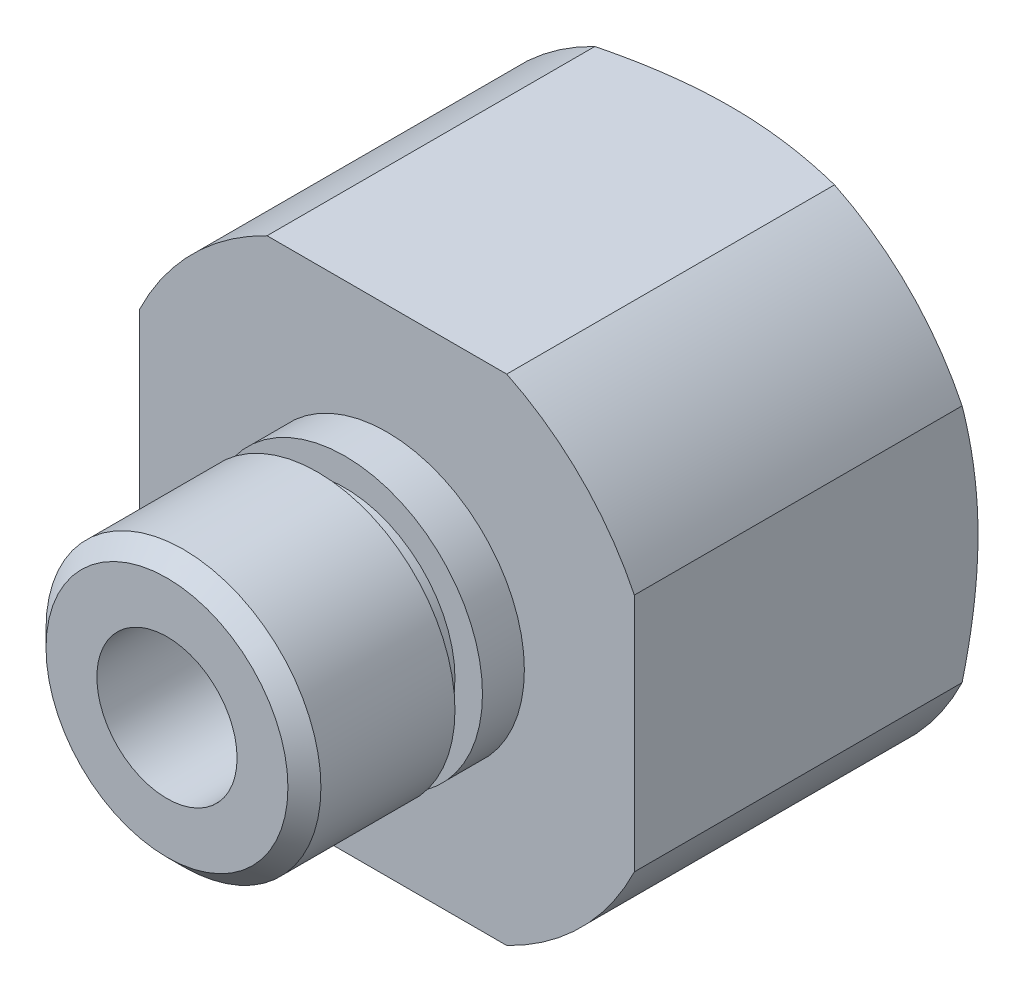
ISO-10303-21;
HEADER;
FILE_DESCRIPTION(('STEP AP214'),'2;1');
FILE_NAME('part.step','',(''),(''),'','','');
FILE_SCHEMA(('AUTOMOTIVE_DESIGN { 1 0 10303 214 1 1 1 1 }'));
ENDSEC;
DATA;
#1=APPLICATION_CONTEXT('core data for automotive mechanical design processes');
#2=APPLICATION_PROTOCOL_DEFINITION('international standard','automotive_design',2000,#1);
#3=PRODUCT_CONTEXT('',#1,'mechanical');
#4=PRODUCT('Part','Part','',(#3));
#5=PRODUCT_RELATED_PRODUCT_CATEGORY('part','',(#4));
#6=PRODUCT_DEFINITION_FORMATION('','',#4);
#7=PRODUCT_DEFINITION_CONTEXT('part definition',#1,'design');
#8=PRODUCT_DEFINITION('design','',#6,#7);
#9=PRODUCT_DEFINITION_SHAPE('','',#8);
#10=(LENGTH_UNIT() NAMED_UNIT(*) SI_UNIT(.MILLI.,.METRE.));
#11=(NAMED_UNIT(*) PLANE_ANGLE_UNIT() SI_UNIT($,.RADIAN.));
#12=(NAMED_UNIT(*) SI_UNIT($,.STERADIAN.) SOLID_ANGLE_UNIT());
#13=UNCERTAINTY_MEASURE_WITH_UNIT(LENGTH_MEASURE(1.E-05),#10,'distance_accuracy_value','');
#14=(GEOMETRIC_REPRESENTATION_CONTEXT(3) GLOBAL_UNCERTAINTY_ASSIGNED_CONTEXT((#13)) GLOBAL_UNIT_ASSIGNED_CONTEXT((#10,
#11,#12)) REPRESENTATION_CONTEXT('',''));
#15=CARTESIAN_POINT('',(0.,0.,0.));
#16=DIRECTION('',(0.,0.,1.));
#17=DIRECTION('',(1.,0.,0.));
#18=AXIS2_PLACEMENT_3D('',#15,#16,#17);
#19=CARTESIAN_POINT('',(0.,0.,20.5));
#20=DIRECTION('',(0.,0.,-1.));
#21=DIRECTION('',(-1.,0.,0.));
#22=AXIS2_PLACEMENT_3D('',#19,#20,#21);
#23=CYLINDRICAL_SURFACE('',#22,5.);
#24=CARTESIAN_POINT('',(0.,0.,12.5));
#25=DIRECTION('',(0.,0.,1.));
#26=DIRECTION('',(1.,0.,0.));
#27=AXIS2_PLACEMENT_3D('',#24,#25,#26);
#28=CIRCLE('',#27,5.);
#29=CARTESIAN_POINT('',(5.,0.,12.5));
#30=VERTEX_POINT('',#29);
#31=EDGE_CURVE('E133',#30,#30,#28,.T.);
#32=ORIENTED_EDGE('',*,*,#31,.T.);
#33=EDGE_LOOP('',(#32));
#34=FACE_BOUND('',#33,.T.);
#35=CARTESIAN_POINT('',(0.,0.,14.0240000000003));
#36=DIRECTION('',(0.,0.,1.));
#37=DIRECTION('',(1.,0.,0.));
#38=AXIS2_PLACEMENT_3D('',#35,#36,#37);
#39=CIRCLE('',#38,5.);
#40=CARTESIAN_POINT('',(5.,0.,14.0240000000003));
#41=VERTEX_POINT('',#40);
#42=EDGE_CURVE('E331',#41,#41,#39,.T.);
#43=ORIENTED_EDGE('',*,*,#42,.F.);
#44=EDGE_LOOP('',(#43));
#45=FACE_BOUND('',#44,.T.);
#46=ADVANCED_FACE('F36',(#34,#45),#23,.T.);
#47=CARTESIAN_POINT('',(0.,0.,0.));
#48=DIRECTION('',(0.,0.,1.));
#49=DIRECTION('',(1.,0.,0.));
#50=AXIS2_PLACEMENT_3D('',#47,#48,#49);
#51=PLANE('',#50);
#52=CARTESIAN_POINT('',(0.,0.,0.));
#53=DIRECTION('',(0.,0.,1.));
#54=DIRECTION('',(1.,0.,0.));
#55=AXIS2_PLACEMENT_3D('',#52,#53,#54);
#56=CIRCLE('',#55,9.);
#57=CARTESIAN_POINT('',(8.99999999999999,0.,0.));
#58=VERTEX_POINT('',#57);
#59=CARTESIAN_POINT('',(0.,-9.,0.));
#60=VERTEX_POINT('',#59);
#61=EDGE_CURVE('E319',#58,#60,#56,.F.);
#62=ORIENTED_EDGE('',*,*,#61,.T.);
#63=CARTESIAN_POINT('',(0.,0.,0.));
#64=DIRECTION('',(0.,0.,1.));
#65=DIRECTION('',(1.,0.,0.));
#66=AXIS2_PLACEMENT_3D('',#63,#64,#65);
#67=CIRCLE('',#66,9.);
#68=CARTESIAN_POINT('',(-8.99999999999999,0.,0.));
#69=VERTEX_POINT('',#68);
#70=EDGE_CURVE('E313',#60,#69,#67,.F.);
#71=ORIENTED_EDGE('',*,*,#70,.T.);
#72=CARTESIAN_POINT('',(0.,0.,0.));
#73=DIRECTION('',(0.,0.,1.));
#74=DIRECTION('',(1.,0.,0.));
#75=AXIS2_PLACEMENT_3D('',#72,#73,#74);
#76=CIRCLE('',#75,9.);
#77=CARTESIAN_POINT('',(0.,9.,0.));
#78=VERTEX_POINT('',#77);
#79=EDGE_CURVE('E317',#69,#78,#76,.F.);
#80=ORIENTED_EDGE('',*,*,#79,.T.);
#81=CARTESIAN_POINT('',(0.,0.,0.));
#82=DIRECTION('',(0.,0.,1.));
#83=DIRECTION('',(1.,0.,0.));
#84=AXIS2_PLACEMENT_3D('',#81,#82,#83);
#85=CIRCLE('',#84,9.);
#86=EDGE_CURVE('E315',#78,#58,#85,.F.);
#87=ORIENTED_EDGE('',*,*,#86,.T.);
#88=EDGE_LOOP('',(#62,#71,#80,#87));
#89=FACE_BOUND('',#88,.T.);
#90=CARTESIAN_POINT('',(0.,0.,0.));
#91=DIRECTION('',(0.,0.,1.));
#92=DIRECTION('',(1.,0.,0.));
#93=AXIS2_PLACEMENT_3D('',#90,#91,#92);
#94=CIRCLE('',#93,2.55);
#95=CARTESIAN_POINT('',(2.55,0.,0.));
#96=VERTEX_POINT('',#95);
#97=EDGE_CURVE('E325',#96,#96,#94,.T.);
#98=ORIENTED_EDGE('',*,*,#97,.T.);
#99=EDGE_LOOP('',(#98));
#100=FACE_BOUND('',#99,.T.);
#101=ADVANCED_FACE('F197',(#89,#100),#51,.F.);
#102=CARTESIAN_POINT('',(0.,0.,20.5));
#103=DIRECTION('',(0.,0.,1.));
#104=DIRECTION('',(1.,0.,0.));
#105=AXIS2_PLACEMENT_3D('',#102,#103,#104);
#106=PLANE('',#105);
#107=CARTESIAN_POINT('',(0.,0.,20.5));
#108=DIRECTION('',(0.,0.,1.));
#109=DIRECTION('',(1.,0.,0.));
#110=AXIS2_PLACEMENT_3D('',#107,#108,#109);
#111=CIRCLE('',#110,4.4);
#112=CARTESIAN_POINT('',(4.4,0.,20.5));
#113=VERTEX_POINT('',#112);
#114=EDGE_CURVE('E44',#113,#113,#111,.T.);
#115=ORIENTED_EDGE('',*,*,#114,.T.);
#116=EDGE_LOOP('',(#115));
#117=FACE_BOUND('',#116,.T.);
#118=CARTESIAN_POINT('',(0.,0.,20.5));
#119=DIRECTION('',(0.,0.,1.));
#120=DIRECTION('',(1.,0.,0.));
#121=AXIS2_PLACEMENT_3D('',#118,#119,#120);
#122=CIRCLE('',#121,2.55);
#123=CARTESIAN_POINT('',(2.55,0.,20.5));
#124=VERTEX_POINT('',#123);
#125=EDGE_CURVE('E327',#124,#124,#122,.T.);
#126=ORIENTED_EDGE('',*,*,#125,.F.);
#127=EDGE_LOOP('',(#126));
#128=FACE_BOUND('',#127,.T.);
#129=ADVANCED_FACE('F201',(#117,#128),#106,.T.);
#130=CARTESIAN_POINT('',(0.,0.,12.5));
#131=DIRECTION('',(0.,0.,1.));
#132=DIRECTION('',(1.,0.,0.));
#133=AXIS2_PLACEMENT_3D('',#130,#131,#132);
#134=PLANE('',#133);
#135=CARTESIAN_POINT('',(0.,0.,12.5));
#136=DIRECTION('',(0.,0.,1.));
#137=DIRECTION('',(1.,0.,0.));
#138=AXIS2_PLACEMENT_3D('',#135,#136,#137);
#139=CIRCLE('',#138,10.);
#140=CARTESIAN_POINT('',(-4.35889894354068,9.,12.5));
#141=VERTEX_POINT('',#140);
#142=CARTESIAN_POINT('',(-8.99999999999999,4.35889894354068,12.5));
#143=VERTEX_POINT('',#142);
#144=EDGE_CURVE('E125',#141,#143,#139,.T.);
#145=ORIENTED_EDGE('',*,*,#144,.T.);
#146=DIRECTION('',(0.,-1.,0.));
#147=VECTOR('',#146,1.);
#148=CARTESIAN_POINT('',(-8.99999999999999,4.35889894354068,12.5));
#149=LINE('',#148,#147);
#150=CARTESIAN_POINT('',(-8.99999999999999,-4.35889894354068,12.5));
#151=VERTEX_POINT('',#150);
#152=EDGE_CURVE('E115',#143,#151,#149,.T.);
#153=ORIENTED_EDGE('',*,*,#152,.T.);
#154=CARTESIAN_POINT('',(0.,0.,12.5));
#155=DIRECTION('',(0.,0.,1.));
#156=DIRECTION('',(1.,0.,0.));
#157=AXIS2_PLACEMENT_3D('',#154,#155,#156);
#158=CIRCLE('',#157,10.);
#159=CARTESIAN_POINT('',(-4.35889894354068,-9.,12.5));
#160=VERTEX_POINT('',#159);
#161=EDGE_CURVE('E124',#151,#160,#158,.T.);
#162=ORIENTED_EDGE('',*,*,#161,.T.);
#163=DIRECTION('',(1.,0.,0.));
#164=VECTOR('',#163,1.);
#165=CARTESIAN_POINT('',(-4.35889894354068,-9.,12.5));
#166=LINE('',#165,#164);
#167=CARTESIAN_POINT('',(4.35889894354067,-9.,12.5));
#168=VERTEX_POINT('',#167);
#169=EDGE_CURVE('E308',#160,#168,#166,.T.);
#170=ORIENTED_EDGE('',*,*,#169,.T.);
#171=CARTESIAN_POINT('',(0.,0.,12.5));
#172=DIRECTION('',(0.,0.,1.));
#173=DIRECTION('',(1.,0.,0.));
#174=AXIS2_PLACEMENT_3D('',#171,#172,#173);
#175=CIRCLE('',#174,10.);
#176=CARTESIAN_POINT('',(8.99999999999999,-4.35889894354068,12.5));
#177=VERTEX_POINT('',#176);
#178=EDGE_CURVE('E338',#168,#177,#175,.T.);
#179=ORIENTED_EDGE('',*,*,#178,.T.);
#180=DIRECTION('',(0.,1.,0.));
#181=VECTOR('',#180,1.);
#182=CARTESIAN_POINT('',(8.99999999999999,4.35889894354068,12.5));
#183=LINE('',#182,#181);
#184=CARTESIAN_POINT('',(8.99999999999999,4.35889894354068,12.5));
#185=VERTEX_POINT('',#184);
#186=EDGE_CURVE('E340',#177,#185,#183,.T.);
#187=ORIENTED_EDGE('',*,*,#186,.T.);
#188=CARTESIAN_POINT('',(0.,0.,12.5));
#189=DIRECTION('',(0.,0.,1.));
#190=DIRECTION('',(1.,0.,0.));
#191=AXIS2_PLACEMENT_3D('',#188,#189,#190);
#192=CIRCLE('',#191,10.);
#193=CARTESIAN_POINT('',(4.35889894354067,9.,12.5));
#194=VERTEX_POINT('',#193);
#195=EDGE_CURVE('E342',#185,#194,#192,.T.);
#196=ORIENTED_EDGE('',*,*,#195,.T.);
#197=DIRECTION('',(-1.,0.,0.));
#198=VECTOR('',#197,1.);
#199=CARTESIAN_POINT('',(-4.35889894354068,9.,12.5));
#200=LINE('',#199,#198);
#201=EDGE_CURVE('E131',#194,#141,#200,.T.);
#202=ORIENTED_EDGE('',*,*,#201,.T.);
#203=EDGE_LOOP('',(#145,#153,#162,#170,#179,#187,#196,#202));
#204=FACE_BOUND('',#203,.T.);
#205=ORIENTED_EDGE('',*,*,#31,.F.);
#206=EDGE_LOOP('',(#205));
#207=FACE_BOUND('',#206,.T.);
#208=ADVANCED_FACE('F128',(#204,#207),#134,.T.);
#209=CARTESIAN_POINT('',(0.,0.,12.5));
#210=DIRECTION('',(0.,0.,-1.));
#211=DIRECTION('',(-1.,0.,0.));
#212=AXIS2_PLACEMENT_3D('',#209,#210,#211);
#213=CYLINDRICAL_SURFACE('',#212,10.);
#214=DIRECTION('',(0.,0.,-1.));
#215=VECTOR('',#214,1.);
#216=CARTESIAN_POINT('',(-4.35889894354068,9.,12.5));
#217=LINE('',#216,#215);
#218=CARTESIAN_POINT('',(-4.35889894354068,9.,0.577350269189633));
#219=VERTEX_POINT('',#218);
#220=EDGE_CURVE('E292',#141,#219,#217,.T.);
#221=ORIENTED_EDGE('',*,*,#220,.T.);
#222=CARTESIAN_POINT('',(0.,0.,0.577350269189637));
#223=DIRECTION('',(0.,0.,1.));
#224=DIRECTION('',(1.,0.,0.));
#225=AXIS2_PLACEMENT_3D('',#222,#223,#224);
#226=CIRCLE('',#225,10.);
#227=CARTESIAN_POINT('',(-8.99999999999999,4.35889894354068,0.577350269189637));
#228=VERTEX_POINT('',#227);
#229=EDGE_CURVE('E137',#219,#228,#226,.T.);
#230=ORIENTED_EDGE('',*,*,#229,.T.);
#231=DIRECTION('',(0.,0.,-1.));
#232=VECTOR('',#231,1.);
#233=CARTESIAN_POINT('',(-8.99999999999999,4.35889894354068,12.5));
#234=LINE('',#233,#232);
#235=EDGE_CURVE('E119',#143,#228,#234,.T.);
#236=ORIENTED_EDGE('',*,*,#235,.F.);
#237=ORIENTED_EDGE('',*,*,#144,.F.);
#238=EDGE_LOOP('',(#221,#230,#236,#237));
#239=FACE_BOUND('',#238,.T.);
#240=ADVANCED_FACE('F38',(#239),#213,.T.);
#241=CARTESIAN_POINT('',(-8.99999999999999,4.35889894354068,12.5));
#242=DIRECTION('',(1.,0.,0.));
#243=DIRECTION('',(0.,0.,-1.));
#244=AXIS2_PLACEMENT_3D('',#241,#242,#243);
#245=PLANE('',#244);
#246=CARTESIAN_POINT('',(-8.99999999999999,4.35889894354068,0.577350269189637));
#247=CARTESIAN_POINT('',(-8.99999999999999,4.18050314028203,0.532457731019368));
#248=CARTESIAN_POINT('',(-8.99999999999999,4.00158687455103,0.489662216447554));
#249=CARTESIAN_POINT('',(-8.99999999999999,3.64267909672018,0.408660352341652));
#250=CARTESIAN_POINT('',(-8.99999999999999,3.46268735803342,0.370455008449579));
#251=CARTESIAN_POINT('',(-8.99999999999999,2.92263369369887,0.263635914482172));
#252=CARTESIAN_POINT('',(-8.99999999999999,2.56104121567905,0.202447293964421));
#253=CARTESIAN_POINT('',(-8.99999999999999,2.016228798539,0.127817138854851));
#254=CARTESIAN_POINT('',(-8.99999999999999,1.83415074090355,0.105794088399086));
#255=CARTESIAN_POINT('',(-8.99999999999999,1.46935836557093,0.0677765215745402));
#256=CARTESIAN_POINT('',(-8.99999999999999,1.28664405347708,0.051781952249427));
#257=CARTESIAN_POINT('',(-8.99999999999999,0.920066567165592,0.026022586714132));
#258=CARTESIAN_POINT('',(-8.99999999999999,0.736201681512132,0.016282095165784));
#259=CARTESIAN_POINT('',(-8.99999999999999,0.368226238571733,0.0032614544224834));
#260=CARTESIAN_POINT('',(-8.99999999999999,0.184115659254636,-1.80701811868844E-05));
#261=CARTESIAN_POINT('',(-8.99999999999999,0.,0.));
#262=B_SPLINE_CURVE_WITH_KNOTS('',3,(#246,#247,#248,#249,#250,#251,#252,#253,#254,#255,#256,
#257,#258,#259,#260,#261),.UNSPECIFIED.,.F.,.F.,(4,2,2,2,2,2,2,4),(0.,0.551840476747492,
1.10380163438757,2.2032324326341,2.75336800253714,3.30349873974013,3.85575466358833,
4.40806397221874),.UNSPECIFIED.);
#263=EDGE_CURVE('E178',#228,#69,#262,.T.);
#264=ORIENTED_EDGE('',*,*,#263,.T.);
#265=CARTESIAN_POINT('',(-8.99999999999999,0.,0.));
#266=CARTESIAN_POINT('',(-8.99999999999999,-0.184115659254636,-1.80701811868755E-05));
#267=CARTESIAN_POINT('',(-8.99999999999999,-0.368226238571733,0.00326145442248342));
#268=CARTESIAN_POINT('',(-8.99999999999999,-0.736201681512132,0.016282095165784));
#269=CARTESIAN_POINT('',(-8.99999999999999,-0.920066567165592,0.0260225867141321));
#270=CARTESIAN_POINT('',(-8.99999999999999,-1.28664405347708,0.051781952249427));
#271=CARTESIAN_POINT('',(-8.99999999999999,-1.46935836557093,0.0677765215745402));
#272=CARTESIAN_POINT('',(-8.99999999999999,-1.83415074090355,0.105794088399086));
#273=CARTESIAN_POINT('',(-8.99999999999999,-2.016228798539,0.127817138854851));
#274=CARTESIAN_POINT('',(-8.99999999999999,-2.56104121567905,0.202447293964421));
#275=CARTESIAN_POINT('',(-8.99999999999999,-2.92263369369887,0.263635914482172));
#276=CARTESIAN_POINT('',(-8.99999999999999,-3.46268735803342,0.370455008449579));
#277=CARTESIAN_POINT('',(-8.99999999999999,-3.64267909672018,0.408660352341652));
#278=CARTESIAN_POINT('',(-8.99999999999999,-4.00158687455103,0.489662216447554));
#279=CARTESIAN_POINT('',(-8.99999999999999,-4.18050314028203,0.532457731019368));
#280=CARTESIAN_POINT('',(-8.99999999999999,-4.35889894354068,0.577350269189637));
#281=B_SPLINE_CURVE_WITH_KNOTS('',3,(#265,#266,#267,#268,#269,#270,#271,#272,#273,#274,#275,
#276,#277,#278,#279,#280),.UNSPECIFIED.,.F.,.F.,(4,2,2,2,2,2,2,4),(0.,0.552309308630403,
1.10456523247861,1.6546959696816,2.20483153958464,3.30426233783117,3.85622349547125,
4.40806397221874),.UNSPECIFIED.);
#282=CARTESIAN_POINT('',(-8.99999999999999,-4.35889894354068,0.577350269189637));
#283=VERTEX_POINT('',#282);
#284=EDGE_CURVE('E184',#69,#283,#281,.T.);
#285=ORIENTED_EDGE('',*,*,#284,.T.);
#286=DIRECTION('',(0.,0.,-1.));
#287=VECTOR('',#286,1.);
#288=CARTESIAN_POINT('',(-8.99999999999999,-4.35889894354068,12.5));
#289=LINE('',#288,#287);
#290=EDGE_CURVE('E121',#151,#283,#289,.T.);
#291=ORIENTED_EDGE('',*,*,#290,.F.);
#292=ORIENTED_EDGE('',*,*,#152,.F.);
#293=ORIENTED_EDGE('',*,*,#235,.T.);
#294=EDGE_LOOP('',(#264,#285,#291,#292,#293));
#295=FACE_BOUND('',#294,.T.);
#296=ADVANCED_FACE('F117',(#295),#245,.F.);
#297=CARTESIAN_POINT('',(0.,0.,12.5));
#298=DIRECTION('',(0.,0.,-1.));
#299=DIRECTION('',(-1.,0.,0.));
#300=AXIS2_PLACEMENT_3D('',#297,#298,#299);
#301=CYLINDRICAL_SURFACE('',#300,10.);
#302=ORIENTED_EDGE('',*,*,#290,.T.);
#303=CARTESIAN_POINT('',(0.,0.,0.577350269189637));
#304=DIRECTION('',(0.,0.,1.));
#305=DIRECTION('',(1.,0.,0.));
#306=AXIS2_PLACEMENT_3D('',#303,#304,#305);
#307=CIRCLE('',#306,10.);
#308=CARTESIAN_POINT('',(-4.35889894354068,-9.,0.577350269189633));
#309=VERTEX_POINT('',#308);
#310=EDGE_CURVE('E138',#283,#309,#307,.T.);
#311=ORIENTED_EDGE('',*,*,#310,.T.);
#312=DIRECTION('',(0.,0.,-1.));
#313=VECTOR('',#312,1.);
#314=CARTESIAN_POINT('',(-4.35889894354068,-9.,12.5));
#315=LINE('',#314,#313);
#316=EDGE_CURVE('E143',#160,#309,#315,.T.);
#317=ORIENTED_EDGE('',*,*,#316,.F.);
#318=ORIENTED_EDGE('',*,*,#161,.F.);
#319=EDGE_LOOP('',(#302,#311,#317,#318));
#320=FACE_BOUND('',#319,.T.);
#321=ADVANCED_FACE('F168',(#320),#301,.T.);
#322=CARTESIAN_POINT('',(-4.35889894354068,-9.,12.5));
#323=DIRECTION('',(0.,1.,0.));
#324=DIRECTION('',(0.,0.,1.));
#325=AXIS2_PLACEMENT_3D('',#322,#323,#324);
#326=PLANE('',#325);
#327=ORIENTED_EDGE('',*,*,#316,.T.);
#328=CARTESIAN_POINT('',(-4.35889894354068,-9.,0.577350269189633));
#329=CARTESIAN_POINT('',(-4.18050314028204,-9.,0.532457731019368));
#330=CARTESIAN_POINT('',(-4.00158687455104,-9.,0.489662216447556));
#331=CARTESIAN_POINT('',(-3.64267909672019,-9.,0.408660352341655));
#332=CARTESIAN_POINT('',(-3.46268735803343,-9.,0.370455008449582));
#333=CARTESIAN_POINT('',(-2.92263369369888,-9.,0.263635914482175));
#334=CARTESIAN_POINT('',(-2.56104121567905,-9.,0.202447293964423));
#335=CARTESIAN_POINT('',(-2.01622879853901,-9.,0.127817138854852));
#336=CARTESIAN_POINT('',(-1.83415074090355,-9.,0.105794088399087));
#337=CARTESIAN_POINT('',(-1.46935836557093,-9.,0.0677765215745424));
#338=CARTESIAN_POINT('',(-1.28664405347709,-9.,0.0517819522494299));
#339=CARTESIAN_POINT('',(-0.920066567165593,-9.,0.0260225867141352));
#340=CARTESIAN_POINT('',(-0.736201681512132,-9.,0.0162820951657866));
#341=CARTESIAN_POINT('',(-0.368226238571734,-9.,0.00326145442248475));
#342=CARTESIAN_POINT('',(-0.184115659254636,-9.,-1.80701811863684E-05));
#343=CARTESIAN_POINT('',(0.,-9.,0.));
#344=B_SPLINE_CURVE_WITH_KNOTS('',3,(#328,#329,#330,#331,#332,#333,#334,#335,#336,#337,#338,
#339,#340,#341,#342,#343),.UNSPECIFIED.,.F.,.F.,(4,2,2,2,2,2,2,4),(0.,0.551840476747492,
1.10380163438757,2.2032324326341,2.75336800253714,3.30349873974013,3.85575466358834,
4.40806397221874),.UNSPECIFIED.);
#345=EDGE_CURVE('E153',#309,#60,#344,.T.);
#346=ORIENTED_EDGE('',*,*,#345,.T.);
#347=CARTESIAN_POINT('',(0.,-8.99999999999999,0.));
#348=CARTESIAN_POINT('',(0.184115659254636,-9.,-1.80701811859352E-05));
#349=CARTESIAN_POINT('',(0.368226238571733,-9.,0.00326145442248501));
#350=CARTESIAN_POINT('',(0.73620168151213,-9.,0.0162820951657863));
#351=CARTESIAN_POINT('',(0.920066567165589,-9.,0.0260225867141344));
#352=CARTESIAN_POINT('',(1.28664405347708,-9.,0.0517819522494288));
#353=CARTESIAN_POINT('',(1.46935836557093,-9.,0.0677765215745414));
#354=CARTESIAN_POINT('',(1.83415074090354,-9.,0.105794088399087));
#355=CARTESIAN_POINT('',(2.016228798539,-9.,0.127817138854852));
#356=CARTESIAN_POINT('',(2.56104121567904,-9.,0.202447293964422));
#357=CARTESIAN_POINT('',(2.92263369369886,-9.,0.263635914482172));
#358=CARTESIAN_POINT('',(3.46268735803342,-9.,0.370455008449579));
#359=CARTESIAN_POINT('',(3.64267909672017,-9.,0.408660352341652));
#360=CARTESIAN_POINT('',(4.00158687455102,-9.,0.489662216447554));
#361=CARTESIAN_POINT('',(4.18050314028202,-9.,0.532457731019367));
#362=CARTESIAN_POINT('',(4.35889894354067,-9.,0.577350269189633));
#363=B_SPLINE_CURVE_WITH_KNOTS('',3,(#347,#348,#349,#350,#351,#352,#353,#354,#355,#356,#357,
#358,#359,#360,#361,#362),.UNSPECIFIED.,.F.,.F.,(4,2,2,2,2,2,2,4),(0.,0.552309308630401,
1.10456523247861,1.65469596968159,2.20483153958463,3.30426233783116,3.85622349547124,
4.40806397221873),.UNSPECIFIED.);
#364=CARTESIAN_POINT('',(4.35889894354067,-9.,0.577350269189637));
#365=VERTEX_POINT('',#364);
#366=EDGE_CURVE('E141',#60,#365,#363,.T.);
#367=ORIENTED_EDGE('',*,*,#366,.T.);
#368=DIRECTION('',(0.,0.,-1.));
#369=VECTOR('',#368,1.);
#370=CARTESIAN_POINT('',(4.35889894354067,-9.,12.5));
#371=LINE('',#370,#369);
#372=EDGE_CURVE('E300',#168,#365,#371,.T.);
#373=ORIENTED_EDGE('',*,*,#372,.F.);
#374=ORIENTED_EDGE('',*,*,#169,.F.);
#375=EDGE_LOOP('',(#327,#346,#367,#373,#374));
#376=FACE_BOUND('',#375,.T.);
#377=ADVANCED_FACE('F162',(#376),#326,.F.);
#378=CARTESIAN_POINT('',(0.,0.,12.5));
#379=DIRECTION('',(0.,0.,-1.));
#380=DIRECTION('',(-1.,0.,0.));
#381=AXIS2_PLACEMENT_3D('',#378,#379,#380);
#382=CYLINDRICAL_SURFACE('',#381,10.);
#383=ORIENTED_EDGE('',*,*,#372,.T.);
#384=CARTESIAN_POINT('',(0.,0.,0.577350269189637));
#385=DIRECTION('',(0.,0.,1.));
#386=DIRECTION('',(1.,0.,0.));
#387=AXIS2_PLACEMENT_3D('',#384,#385,#386);
#388=CIRCLE('',#387,10.);
#389=CARTESIAN_POINT('',(8.99999999999999,-4.35889894354068,0.577350269189637));
#390=VERTEX_POINT('',#389);
#391=EDGE_CURVE('E189',#365,#390,#388,.T.);
#392=ORIENTED_EDGE('',*,*,#391,.T.);
#393=DIRECTION('',(0.,0.,-1.));
#394=VECTOR('',#393,1.);
#395=CARTESIAN_POINT('',(8.99999999999999,-4.35889894354068,12.5));
#396=LINE('',#395,#394);
#397=EDGE_CURVE('E294',#177,#390,#396,.T.);
#398=ORIENTED_EDGE('',*,*,#397,.F.);
#399=ORIENTED_EDGE('',*,*,#178,.F.);
#400=EDGE_LOOP('',(#383,#392,#398,#399));
#401=FACE_BOUND('',#400,.T.);
#402=ADVANCED_FACE('F167',(#401),#382,.T.);
#403=CARTESIAN_POINT('',(8.99999999999999,4.35889894354068,12.5));
#404=DIRECTION('',(-1.,0.,0.));
#405=DIRECTION('',(0.,0.,1.));
#406=AXIS2_PLACEMENT_3D('',#403,#404,#405);
#407=PLANE('',#406);
#408=ORIENTED_EDGE('',*,*,#397,.T.);
#409=CARTESIAN_POINT('',(8.99999999999999,-4.35889894354068,0.577350269189637));
#410=CARTESIAN_POINT('',(8.99999999999999,-4.18050314028203,0.532457731019368));
#411=CARTESIAN_POINT('',(8.99999999999999,-4.00158687455103,0.489662216447554));
#412=CARTESIAN_POINT('',(8.99999999999999,-3.64267909672018,0.408660352341652));
#413=CARTESIAN_POINT('',(8.99999999999999,-3.46268735803342,0.370455008449579));
#414=CARTESIAN_POINT('',(8.99999999999999,-2.92263369369887,0.263635914482172));
#415=CARTESIAN_POINT('',(8.99999999999999,-2.56104121567905,0.202447293964421));
#416=CARTESIAN_POINT('',(8.99999999999999,-2.016228798539,0.127817138854851));
#417=CARTESIAN_POINT('',(8.99999999999999,-1.83415074090355,0.105794088399086));
#418=CARTESIAN_POINT('',(8.99999999999999,-1.46935836557093,0.0677765215745402));
#419=CARTESIAN_POINT('',(8.99999999999999,-1.28664405347708,0.051781952249427));
#420=CARTESIAN_POINT('',(8.99999999999999,-0.920066567165592,0.026022586714132));
#421=CARTESIAN_POINT('',(8.99999999999999,-0.736201681512132,0.016282095165784));
#422=CARTESIAN_POINT('',(8.99999999999999,-0.368226238571733,0.0032614544224834));
#423=CARTESIAN_POINT('',(8.99999999999999,-0.184115659254636,-1.80701811868844E-05));
#424=CARTESIAN_POINT('',(8.99999999999999,0.,0.));
#425=B_SPLINE_CURVE_WITH_KNOTS('',3,(#409,#410,#411,#412,#413,#414,#415,#416,#417,#418,#419,
#420,#421,#422,#423,#424),.UNSPECIFIED.,.F.,.F.,(4,2,2,2,2,2,2,4),(0.,0.551840476747492,
1.10380163438757,2.2032324326341,2.75336800253714,3.30349873974013,3.85575466358833,
4.40806397221874),.UNSPECIFIED.);
#426=EDGE_CURVE('E239',#390,#58,#425,.T.);
#427=ORIENTED_EDGE('',*,*,#426,.T.);
#428=CARTESIAN_POINT('',(8.99999999999999,0.,0.));
#429=CARTESIAN_POINT('',(8.99999999999999,0.184115659254636,-1.80701811868755E-05));
#430=CARTESIAN_POINT('',(8.99999999999999,0.368226238571733,0.00326145442248342));
#431=CARTESIAN_POINT('',(8.99999999999999,0.736201681512132,0.016282095165784));
#432=CARTESIAN_POINT('',(8.99999999999999,0.920066567165592,0.0260225867141321));
#433=CARTESIAN_POINT('',(8.99999999999999,1.28664405347708,0.051781952249427));
#434=CARTESIAN_POINT('',(8.99999999999999,1.46935836557093,0.0677765215745402));
#435=CARTESIAN_POINT('',(8.99999999999999,1.83415074090355,0.105794088399086));
#436=CARTESIAN_POINT('',(8.99999999999999,2.016228798539,0.127817138854851));
#437=CARTESIAN_POINT('',(8.99999999999999,2.56104121567905,0.202447293964421));
#438=CARTESIAN_POINT('',(8.99999999999999,2.92263369369887,0.263635914482172));
#439=CARTESIAN_POINT('',(8.99999999999999,3.46268735803342,0.370455008449579));
#440=CARTESIAN_POINT('',(8.99999999999999,3.64267909672018,0.408660352341652));
#441=CARTESIAN_POINT('',(8.99999999999999,4.00158687455103,0.489662216447554));
#442=CARTESIAN_POINT('',(8.99999999999999,4.18050314028203,0.532457731019368));
#443=CARTESIAN_POINT('',(8.99999999999999,4.35889894354068,0.577350269189637));
#444=B_SPLINE_CURVE_WITH_KNOTS('',3,(#428,#429,#430,#431,#432,#433,#434,#435,#436,#437,#438,
#439,#440,#441,#442,#443),.UNSPECIFIED.,.F.,.F.,(4,2,2,2,2,2,2,4),(0.,0.552309308630403,
1.10456523247861,1.6546959696816,2.20483153958464,3.30426233783117,3.85622349547125,
4.40806397221874),.UNSPECIFIED.);
#445=CARTESIAN_POINT('',(8.99999999999999,4.35889894354068,0.577350269189637));
#446=VERTEX_POINT('',#445);
#447=EDGE_CURVE('E234',#58,#446,#444,.T.);
#448=ORIENTED_EDGE('',*,*,#447,.T.);
#449=DIRECTION('',(0.,0.,-1.));
#450=VECTOR('',#449,1.);
#451=CARTESIAN_POINT('',(8.99999999999999,4.35889894354068,12.5));
#452=LINE('',#451,#450);
#453=EDGE_CURVE('E289',#185,#446,#452,.T.);
#454=ORIENTED_EDGE('',*,*,#453,.F.);
#455=ORIENTED_EDGE('',*,*,#186,.F.);
#456=EDGE_LOOP('',(#408,#427,#448,#454,#455));
#457=FACE_BOUND('',#456,.T.);
#458=ADVANCED_FACE('F243',(#457),#407,.F.);
#459=CARTESIAN_POINT('',(0.,0.,12.5));
#460=DIRECTION('',(0.,0.,-1.));
#461=DIRECTION('',(-1.,0.,0.));
#462=AXIS2_PLACEMENT_3D('',#459,#460,#461);
#463=CYLINDRICAL_SURFACE('',#462,10.);
#464=ORIENTED_EDGE('',*,*,#453,.T.);
#465=CARTESIAN_POINT('',(0.,0.,0.577350269189637));
#466=DIRECTION('',(0.,0.,1.));
#467=DIRECTION('',(1.,0.,0.));
#468=AXIS2_PLACEMENT_3D('',#465,#466,#467);
#469=CIRCLE('',#468,10.);
#470=CARTESIAN_POINT('',(4.35889894354067,9.,0.577350269189637));
#471=VERTEX_POINT('',#470);
#472=EDGE_CURVE('E221',#446,#471,#469,.T.);
#473=ORIENTED_EDGE('',*,*,#472,.T.);
#474=DIRECTION('',(0.,0.,-1.));
#475=VECTOR('',#474,1.);
#476=CARTESIAN_POINT('',(4.35889894354067,9.,12.5));
#477=LINE('',#476,#475);
#478=EDGE_CURVE('E287',#194,#471,#477,.T.);
#479=ORIENTED_EDGE('',*,*,#478,.F.);
#480=ORIENTED_EDGE('',*,*,#195,.F.);
#481=EDGE_LOOP('',(#464,#473,#479,#480));
#482=FACE_BOUND('',#481,.T.);
#483=ADVANCED_FACE('F208',(#482),#463,.T.);
#484=CARTESIAN_POINT('',(-4.35889894354068,9.,12.5));
#485=DIRECTION('',(0.,-1.,0.));
#486=DIRECTION('',(0.,0.,-1.));
#487=AXIS2_PLACEMENT_3D('',#484,#485,#486);
#488=PLANE('',#487);
#489=CARTESIAN_POINT('',(4.35889894354067,9.,0.577350269189637));
#490=CARTESIAN_POINT('',(4.18050314028203,9.,0.532457731019368));
#491=CARTESIAN_POINT('',(4.00158687455102,9.,0.489662216447555));
#492=CARTESIAN_POINT('',(3.64267909672017,9.,0.408660352341653));
#493=CARTESIAN_POINT('',(3.46268735803342,9.,0.37045500844958));
#494=CARTESIAN_POINT('',(2.92263369369886,9.,0.263635914482175));
#495=CARTESIAN_POINT('',(2.56104121567904,9.,0.202447293964424));
#496=CARTESIAN_POINT('',(2.016228798539,9.,0.127817138854853));
#497=CARTESIAN_POINT('',(1.83415074090354,9.,0.105794088399088));
#498=CARTESIAN_POINT('',(1.46935836557093,9.,0.0677765215745434));
#499=CARTESIAN_POINT('',(1.28664405347708,9.,0.0517819522494309));
#500=CARTESIAN_POINT('',(0.92006656716559,9.,0.0260225867141363));
#501=CARTESIAN_POINT('',(0.73620168151213,9.,0.0162820951657877));
#502=CARTESIAN_POINT('',(0.368226238571733,9.,0.0032614544224856));
#503=CARTESIAN_POINT('',(0.184115659254636,9.,-1.80701811857747E-05));
#504=CARTESIAN_POINT('',(0.,9.,0.));
#505=B_SPLINE_CURVE_WITH_KNOTS('',3,(#489,#490,#491,#492,#493,#494,#495,#496,#497,#498,#499,
#500,#501,#502,#503,#504),.UNSPECIFIED.,.F.,.F.,(4,2,2,2,2,2,2,4),(0.,0.55184047674749,
1.10380163438756,2.20323243263409,2.75336800253713,3.30349873974012,3.85575466358833,
4.40806397221873),.UNSPECIFIED.);
#506=EDGE_CURVE('E51',#471,#78,#505,.T.);
#507=ORIENTED_EDGE('',*,*,#506,.T.);
#508=CARTESIAN_POINT('',(0.,8.99999999999999,0.));
#509=CARTESIAN_POINT('',(-0.184115659254636,9.,-1.80701811842363E-05));
#510=CARTESIAN_POINT('',(-0.368226238571734,9.,0.00326145442248711));
#511=CARTESIAN_POINT('',(-0.736201681512133,9.,0.0162820951657884));
#512=CARTESIAN_POINT('',(-0.920066567165593,9.,0.0260225867141362));
#513=CARTESIAN_POINT('',(-1.28664405347709,9.,0.0517819522494309));
#514=CARTESIAN_POINT('',(-1.46935836557093,9.,0.0677765215745442));
#515=CARTESIAN_POINT('',(-1.83415074090355,9.,0.10579408839909));
#516=CARTESIAN_POINT('',(-2.01622879853901,9.,0.127817138854855));
#517=CARTESIAN_POINT('',(-2.56104121567905,9.,0.202447293964424));
#518=CARTESIAN_POINT('',(-2.92263369369887,9.,0.263635914482175));
#519=CARTESIAN_POINT('',(-3.46268735803343,9.,0.370455008449583));
#520=CARTESIAN_POINT('',(-3.64267909672018,9.,0.408660352341657));
#521=CARTESIAN_POINT('',(-4.00158687455103,9.,0.489662216447558));
#522=CARTESIAN_POINT('',(-4.18050314028204,9.,0.53245773101937));
#523=CARTESIAN_POINT('',(-4.35889894354068,9.,0.577350269189633));
#524=B_SPLINE_CURVE_WITH_KNOTS('',3,(#508,#509,#510,#511,#512,#513,#514,#515,#516,#517,#518,
#519,#520,#521,#522,#523),.UNSPECIFIED.,.F.,.F.,(4,2,2,2,2,2,2,4),(0.,0.552309308630403,
1.10456523247861,1.6546959696816,2.20483153958464,3.30426233783118,3.85622349547125,
4.40806397221874),.UNSPECIFIED.);
#525=EDGE_CURVE('E58',#78,#219,#524,.T.);
#526=ORIENTED_EDGE('',*,*,#525,.T.);
#527=ORIENTED_EDGE('',*,*,#220,.F.);
#528=ORIENTED_EDGE('',*,*,#201,.F.);
#529=ORIENTED_EDGE('',*,*,#478,.T.);
#530=EDGE_LOOP('',(#507,#526,#527,#528,#529));
#531=FACE_BOUND('',#530,.T.);
#532=ADVANCED_FACE('F195',(#531),#488,.F.);
#533=CARTESIAN_POINT('',(0.,0.,0.577350269189637));
#534=DIRECTION('',(0.,0.,1.));
#535=DIRECTION('',(1.,0.,0.));
#536=AXIS2_PLACEMENT_3D('',#533,#534,#535);
#537=CONICAL_SURFACE('',#536,10.,1.04719755119659);
#538=ORIENTED_EDGE('',*,*,#284,.F.);
#539=ORIENTED_EDGE('',*,*,#70,.F.);
#540=ORIENTED_EDGE('',*,*,#345,.F.);
#541=ORIENTED_EDGE('',*,*,#310,.F.);
#542=EDGE_LOOP('',(#538,#539,#540,#541));
#543=FACE_BOUND('',#542,.T.);
#544=ADVANCED_FACE('F191',(#543),#537,.T.);
#545=CARTESIAN_POINT('',(0.,0.,0.577350269189637));
#546=DIRECTION('',(0.,0.,1.));
#547=DIRECTION('',(1.,0.,0.));
#548=AXIS2_PLACEMENT_3D('',#545,#546,#547);
#549=CONICAL_SURFACE('',#548,10.,1.04719755119659);
#550=ORIENTED_EDGE('',*,*,#366,.F.);
#551=ORIENTED_EDGE('',*,*,#61,.F.);
#552=ORIENTED_EDGE('',*,*,#426,.F.);
#553=ORIENTED_EDGE('',*,*,#391,.F.);
#554=EDGE_LOOP('',(#550,#551,#552,#553));
#555=FACE_BOUND('',#554,.T.);
#556=ADVANCED_FACE('F159',(#555),#549,.T.);
#557=CARTESIAN_POINT('',(0.,0.,0.577350269189637));
#558=DIRECTION('',(0.,0.,1.));
#559=DIRECTION('',(1.,0.,0.));
#560=AXIS2_PLACEMENT_3D('',#557,#558,#559);
#561=CONICAL_SURFACE('',#560,10.,1.04719755119659);
#562=ORIENTED_EDGE('',*,*,#525,.F.);
#563=ORIENTED_EDGE('',*,*,#79,.F.);
#564=ORIENTED_EDGE('',*,*,#263,.F.);
#565=ORIENTED_EDGE('',*,*,#229,.F.);
#566=EDGE_LOOP('',(#562,#563,#564,#565));
#567=FACE_BOUND('',#566,.T.);
#568=ADVANCED_FACE('F222',(#567),#561,.T.);
#569=CARTESIAN_POINT('',(0.,0.,0.577350269189637));
#570=DIRECTION('',(0.,0.,1.));
#571=DIRECTION('',(1.,0.,0.));
#572=AXIS2_PLACEMENT_3D('',#569,#570,#571);
#573=CONICAL_SURFACE('',#572,10.,1.04719755119659);
#574=ORIENTED_EDGE('',*,*,#447,.F.);
#575=ORIENTED_EDGE('',*,*,#86,.F.);
#576=ORIENTED_EDGE('',*,*,#506,.F.);
#577=ORIENTED_EDGE('',*,*,#472,.F.);
#578=EDGE_LOOP('',(#574,#575,#576,#577));
#579=FACE_BOUND('',#578,.T.);
#580=ADVANCED_FACE('F225',(#579),#573,.T.);
#581=CARTESIAN_POINT('',(0.,0.,15.0240000000003));
#582=DIRECTION('',(0.,0.,1.));
#583=DIRECTION('',(1.,0.,0.));
#584=AXIS2_PLACEMENT_3D('',#581,#582,#583);
#585=CIRCLE('',#584,5.);
#586=CARTESIAN_POINT('',(5.,0.,15.0240000000003));
#587=VERTEX_POINT('',#586);
#588=EDGE_CURVE('E273',#587,#587,#585,.T.);
#589=ORIENTED_EDGE('',*,*,#588,.T.);
#590=EDGE_LOOP('',(#589));
#591=FACE_BOUND('',#590,.T.);
#592=CARTESIAN_POINT('',(0.,0.,19.9));
#593=DIRECTION('',(0.,0.,1.));
#594=DIRECTION('',(1.,0.,0.));
#595=AXIS2_PLACEMENT_3D('',#592,#593,#594);
#596=CIRCLE('',#595,5.);
#597=CARTESIAN_POINT('',(5.,0.,19.9));
#598=VERTEX_POINT('',#597);
#599=EDGE_CURVE('E11',#598,#598,#596,.F.);
#600=ORIENTED_EDGE('',*,*,#599,.T.);
#601=EDGE_LOOP('',(#600));
#602=FACE_BOUND('',#601,.T.);
#603=ADVANCED_FACE('F231',(#591,#602),#23,.T.);
#604=CARTESIAN_POINT('',(0.,0.,20.5));
#605=DIRECTION('',(0.,0.,-1.));
#606=DIRECTION('',(-1.,0.,0.));
#607=AXIS2_PLACEMENT_3D('',#604,#605,#606);
#608=CYLINDRICAL_SURFACE('',#607,2.55);
#609=ORIENTED_EDGE('',*,*,#125,.T.);
#610=EDGE_LOOP('',(#609));
#611=FACE_BOUND('',#610,.T.);
#612=ORIENTED_EDGE('',*,*,#97,.F.);
#613=EDGE_LOOP('',(#612));
#614=FACE_BOUND('',#613,.T.);
#615=ADVANCED_FACE('F262',(#611,#614),#608,.F.);
#616=CARTESIAN_POINT('',(0.,0.,20.5));
#617=DIRECTION('',(0.,0.,-1.));
#618=DIRECTION('',(-1.,0.,0.));
#619=AXIS2_PLACEMENT_3D('',#616,#617,#618);
#620=CONICAL_SURFACE('',#619,4.4,0.785398163397448);
#621=ORIENTED_EDGE('',*,*,#599,.F.);
#622=EDGE_LOOP('',(#621));
#623=FACE_BOUND('',#622,.T.);
#624=ORIENTED_EDGE('',*,*,#114,.F.);
#625=EDGE_LOOP('',(#624));
#626=FACE_BOUND('',#625,.T.);
#627=ADVANCED_FACE('F267',(#623,#626),#620,.T.);
#628=CARTESIAN_POINT('',(0.,0.,15.0240000000003));
#629=DIRECTION('',(0.,0.,1.));
#630=DIRECTION('',(1.,0.,0.));
#631=AXIS2_PLACEMENT_3D('',#628,#629,#630);
#632=PLANE('',#631);
#633=ORIENTED_EDGE('',*,*,#588,.F.);
#634=EDGE_LOOP('',(#633));
#635=FACE_BOUND('',#634,.T.);
#636=CARTESIAN_POINT('',(0.,0.,15.0240000000003));
#637=DIRECTION('',(0.,0.,1.));
#638=DIRECTION('',(1.,0.,0.));
#639=AXIS2_PLACEMENT_3D('',#636,#637,#638);
#640=CIRCLE('',#639,4.);
#641=CARTESIAN_POINT('',(4.,0.,15.0240000000003));
#642=VERTEX_POINT('',#641);
#643=EDGE_CURVE('E494',#642,#642,#640,.T.);
#644=ORIENTED_EDGE('',*,*,#643,.T.);
#645=EDGE_LOOP('',(#644));
#646=FACE_BOUND('',#645,.T.);
#647=ADVANCED_FACE('F278',(#635,#646),#632,.F.);
#648=CARTESIAN_POINT('',(0.,0.,14.0240000000003));
#649=DIRECTION('',(0.,0.,1.));
#650=DIRECTION('',(1.,0.,0.));
#651=AXIS2_PLACEMENT_3D('',#648,#649,#650);
#652=PLANE('',#651);
#653=ORIENTED_EDGE('',*,*,#42,.T.);
#654=EDGE_LOOP('',(#653));
#655=FACE_BOUND('',#654,.T.);
#656=CARTESIAN_POINT('',(0.,0.,14.0240000000003));
#657=DIRECTION('',(0.,0.,1.));
#658=DIRECTION('',(1.,0.,0.));
#659=AXIS2_PLACEMENT_3D('',#656,#657,#658);
#660=CIRCLE('',#659,4.);
#661=CARTESIAN_POINT('',(4.,0.,14.0240000000003));
#662=VERTEX_POINT('',#661);
#663=EDGE_CURVE('E497',#662,#662,#660,.T.);
#664=ORIENTED_EDGE('',*,*,#663,.F.);
#665=EDGE_LOOP('',(#664));
#666=FACE_BOUND('',#665,.T.);
#667=ADVANCED_FACE('F391',(#655,#666),#652,.T.);
#668=CARTESIAN_POINT('',(0.,0.,15.0240000000003));
#669=DIRECTION('',(0.,0.,-1.));
#670=DIRECTION('',(-1.,0.,0.));
#671=AXIS2_PLACEMENT_3D('',#668,#669,#670);
#672=CYLINDRICAL_SURFACE('',#671,4.);
#673=ORIENTED_EDGE('',*,*,#643,.F.);
#674=EDGE_LOOP('',(#673));
#675=FACE_BOUND('',#674,.T.);
#676=ORIENTED_EDGE('',*,*,#663,.T.);
#677=EDGE_LOOP('',(#676));
#678=FACE_BOUND('',#677,.T.);
#679=ADVANCED_FACE('F401',(#675,#678),#672,.T.);
#680=CLOSED_SHELL('',(#46,#101,#129,#208,#240,#296,#321,#377,#402,#458,#483,#532,#544,#556,#568,
#580,#603,#615,#627,#647,#667,#679));
#681=MANIFOLD_SOLID_BREP('B2',#680);
#682=ADVANCED_BREP_SHAPE_REPRESENTATION('',(#18,#681),#14);
#683=SHAPE_DEFINITION_REPRESENTATION(#9,#682);
ENDSEC;
END-ISO-10303-21;
